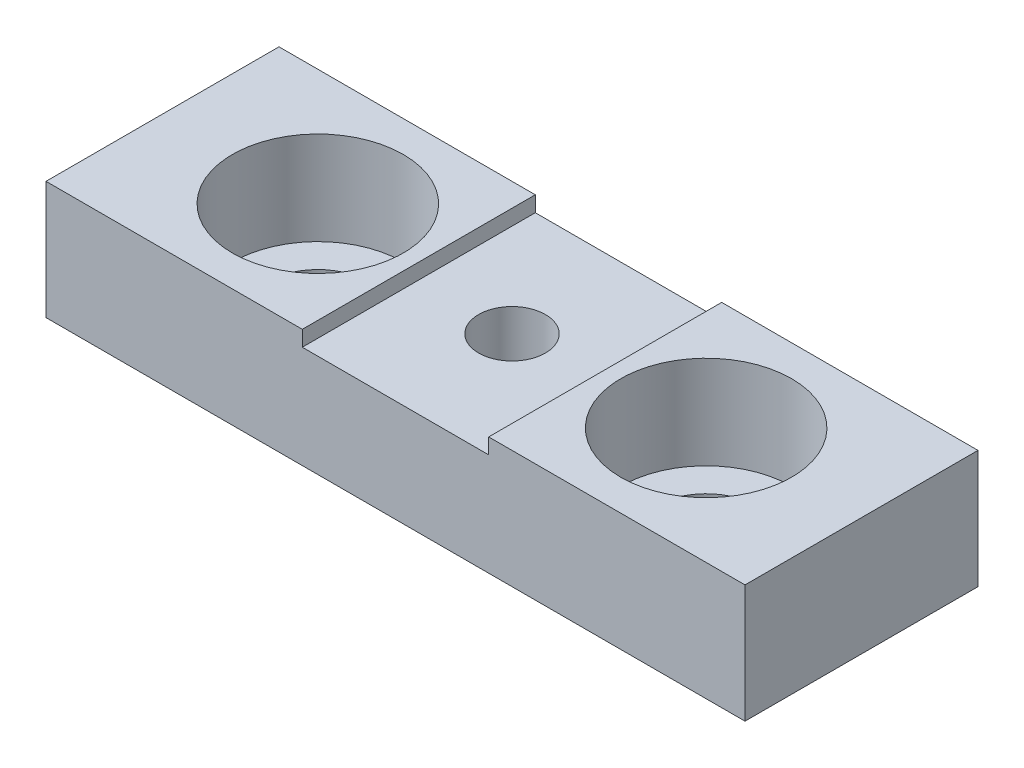
ISO-10303-21;
HEADER;
FILE_DESCRIPTION(('STEP AP214'),'2;1');
FILE_NAME('part.step','',(''),(''),'','','');
FILE_SCHEMA(('AUTOMOTIVE_DESIGN { 1 0 10303 214 1 1 1 1 }'));
ENDSEC;
DATA;
#1=APPLICATION_CONTEXT('core data for automotive mechanical design processes');
#2=APPLICATION_PROTOCOL_DEFINITION('international standard','automotive_design',2000,#1);
#3=PRODUCT_CONTEXT('',#1,'mechanical');
#4=PRODUCT('Part','Part','',(#3));
#5=PRODUCT_RELATED_PRODUCT_CATEGORY('part','',(#4));
#6=PRODUCT_DEFINITION_FORMATION('','',#4);
#7=PRODUCT_DEFINITION_CONTEXT('part definition',#1,'design');
#8=PRODUCT_DEFINITION('design','',#6,#7);
#9=PRODUCT_DEFINITION_SHAPE('','',#8);
#10=(LENGTH_UNIT() NAMED_UNIT(*) SI_UNIT(.MILLI.,.METRE.));
#11=(NAMED_UNIT(*) PLANE_ANGLE_UNIT() SI_UNIT($,.RADIAN.));
#12=(NAMED_UNIT(*) SI_UNIT($,.STERADIAN.) SOLID_ANGLE_UNIT());
#13=UNCERTAINTY_MEASURE_WITH_UNIT(LENGTH_MEASURE(1.E-05),#10,'distance_accuracy_value','');
#14=(GEOMETRIC_REPRESENTATION_CONTEXT(3) GLOBAL_UNCERTAINTY_ASSIGNED_CONTEXT((#13)) GLOBAL_UNIT_ASSIGNED_CONTEXT((#10,
#11,#12)) REPRESENTATION_CONTEXT('',''));
#15=CARTESIAN_POINT('',(0.,0.,0.));
#16=DIRECTION('',(0.,0.,1.));
#17=DIRECTION('',(1.,0.,0.));
#18=AXIS2_PLACEMENT_3D('',#15,#16,#17);
#19=CARTESIAN_POINT('',(0.,7.6,0.));
#20=DIRECTION('',(0.,-1.,0.));
#21=DIRECTION('',(0.,0.,-1.));
#22=AXIS2_PLACEMENT_3D('',#19,#20,#21);
#23=PLANE('',#22);
#24=CARTESIAN_POINT('',(-12.5,7.6,0.));
#25=DIRECTION('',(0.,1.,0.));
#26=DIRECTION('',(0.,0.,1.));
#27=AXIS2_PLACEMENT_3D('',#24,#25,#26);
#28=CIRCLE('',#27,5.5);
#29=CARTESIAN_POINT('',(-12.5,7.6,5.5));
#30=VERTEX_POINT('',#29);
#31=EDGE_CURVE('E134',#30,#30,#28,.T.);
#32=ORIENTED_EDGE('',*,*,#31,.F.);
#33=EDGE_LOOP('',(#32));
#34=FACE_BOUND('',#33,.T.);
#35=DIRECTION('',(1.,0.,0.));
#36=VECTOR('',#35,1.);
#37=CARTESIAN_POINT('',(-22.5,7.6,7.5));
#38=LINE('',#37,#36);
#39=CARTESIAN_POINT('',(-22.5,7.6,7.5));
#40=VERTEX_POINT('',#39);
#41=CARTESIAN_POINT('',(-6.,7.6,7.5));
#42=VERTEX_POINT('',#41);
#43=EDGE_CURVE('E168',#40,#42,#38,.T.);
#44=ORIENTED_EDGE('',*,*,#43,.T.);
#45=DIRECTION('',(0.,0.,1.));
#46=VECTOR('',#45,1.);
#47=CARTESIAN_POINT('',(-6.,7.6,-7.5));
#48=LINE('',#47,#46);
#49=CARTESIAN_POINT('',(-6.,7.6,-7.5));
#50=VERTEX_POINT('',#49);
#51=EDGE_CURVE('E199',#50,#42,#48,.T.);
#52=ORIENTED_EDGE('',*,*,#51,.F.);
#53=DIRECTION('',(-1.,0.,0.));
#54=VECTOR('',#53,1.);
#55=CARTESIAN_POINT('',(-22.5,7.6,-7.5));
#56=LINE('',#55,#54);
#57=CARTESIAN_POINT('',(-22.5,7.6,-7.5));
#58=VERTEX_POINT('',#57);
#59=EDGE_CURVE('E164',#50,#58,#56,.T.);
#60=ORIENTED_EDGE('',*,*,#59,.T.);
#61=DIRECTION('',(0.,0.,1.));
#62=VECTOR('',#61,1.);
#63=CARTESIAN_POINT('',(-22.5,7.6,7.5));
#64=LINE('',#63,#62);
#65=EDGE_CURVE('E166',#58,#40,#64,.T.);
#66=ORIENTED_EDGE('',*,*,#65,.T.);
#67=EDGE_LOOP('',(#44,#52,#60,#66));
#68=FACE_BOUND('',#67,.T.);
#69=ADVANCED_FACE('F36',(#34,#68),#23,.F.);
#70=CARTESIAN_POINT('',(0.,7.6,0.));
#71=DIRECTION('',(0.,-1.,0.));
#72=DIRECTION('',(0.,0.,-1.));
#73=AXIS2_PLACEMENT_3D('',#70,#71,#72);
#74=CYLINDRICAL_SURFACE('',#73,2.15);
#75=CARTESIAN_POINT('',(0.,0.,0.));
#76=DIRECTION('',(0.,1.,0.));
#77=DIRECTION('',(0.,0.,1.));
#78=AXIS2_PLACEMENT_3D('',#75,#76,#77);
#79=CIRCLE('',#78,2.15);
#80=CARTESIAN_POINT('',(0.,0.,2.15));
#81=VERTEX_POINT('',#80);
#82=EDGE_CURVE('E158',#81,#81,#79,.T.);
#83=ORIENTED_EDGE('',*,*,#82,.F.);
#84=EDGE_LOOP('',(#83));
#85=FACE_BOUND('',#84,.T.);
#86=CARTESIAN_POINT('',(0.,6.6,0.));
#87=DIRECTION('',(0.,1.,0.));
#88=DIRECTION('',(0.,0.,1.));
#89=AXIS2_PLACEMENT_3D('',#86,#87,#88);
#90=CIRCLE('',#89,2.15);
#91=CARTESIAN_POINT('',(0.,6.6,2.15));
#92=VERTEX_POINT('',#91);
#93=EDGE_CURVE('E40',#92,#92,#90,.T.);
#94=ORIENTED_EDGE('',*,*,#93,.T.);
#95=EDGE_LOOP('',(#94));
#96=FACE_BOUND('',#95,.T.);
#97=ADVANCED_FACE('F210',(#85,#96),#74,.F.);
#98=CARTESIAN_POINT('',(0.,0.,0.));
#99=DIRECTION('',(0.,-1.,0.));
#100=DIRECTION('',(0.,0.,-1.));
#101=AXIS2_PLACEMENT_3D('',#98,#99,#100);
#102=PLANE('',#101);
#103=ORIENTED_EDGE('',*,*,#82,.T.);
#104=EDGE_LOOP('',(#103));
#105=FACE_BOUND('',#104,.T.);
#106=DIRECTION('',(0.,0.,-1.));
#107=VECTOR('',#106,1.);
#108=CARTESIAN_POINT('',(22.5,0.,7.5));
#109=LINE('',#108,#107);
#110=CARTESIAN_POINT('',(22.5,0.,7.5));
#111=VERTEX_POINT('',#110);
#112=CARTESIAN_POINT('',(22.5,0.,-7.5));
#113=VERTEX_POINT('',#112);
#114=EDGE_CURVE('E161',#111,#113,#109,.T.);
#115=ORIENTED_EDGE('',*,*,#114,.F.);
#116=DIRECTION('',(1.,0.,0.));
#117=VECTOR('',#116,1.);
#118=CARTESIAN_POINT('',(-22.5,0.,7.5));
#119=LINE('',#118,#117);
#120=CARTESIAN_POINT('',(-22.5,0.,7.5));
#121=VERTEX_POINT('',#120);
#122=EDGE_CURVE('E83',#121,#111,#119,.T.);
#123=ORIENTED_EDGE('',*,*,#122,.F.);
#124=DIRECTION('',(0.,0.,1.));
#125=VECTOR('',#124,1.);
#126=CARTESIAN_POINT('',(-22.5,0.,7.5));
#127=LINE('',#126,#125);
#128=CARTESIAN_POINT('',(-22.5,0.,-7.5));
#129=VERTEX_POINT('',#128);
#130=EDGE_CURVE('E176',#129,#121,#127,.T.);
#131=ORIENTED_EDGE('',*,*,#130,.F.);
#132=DIRECTION('',(-1.,0.,0.));
#133=VECTOR('',#132,1.);
#134=CARTESIAN_POINT('',(-22.5,0.,-7.5));
#135=LINE('',#134,#133);
#136=EDGE_CURVE('E174',#113,#129,#135,.T.);
#137=ORIENTED_EDGE('',*,*,#136,.F.);
#138=EDGE_LOOP('',(#115,#123,#131,#137));
#139=FACE_BOUND('',#138,.T.);
#140=CARTESIAN_POINT('',(12.5,0.,0.));
#141=DIRECTION('',(0.,1.,0.));
#142=DIRECTION('',(0.,0.,1.));
#143=AXIS2_PLACEMENT_3D('',#140,#141,#142);
#144=CIRCLE('',#143,3.3);
#145=CARTESIAN_POINT('',(12.5,0.,3.3));
#146=VERTEX_POINT('',#145);
#147=EDGE_CURVE('E155',#146,#146,#144,.T.);
#148=ORIENTED_EDGE('',*,*,#147,.T.);
#149=EDGE_LOOP('',(#148));
#150=FACE_BOUND('',#149,.T.);
#151=CARTESIAN_POINT('',(-12.5,0.,0.));
#152=DIRECTION('',(0.,1.,0.));
#153=DIRECTION('',(0.,0.,1.));
#154=AXIS2_PLACEMENT_3D('',#151,#152,#153);
#155=CIRCLE('',#154,3.3);
#156=CARTESIAN_POINT('',(-12.5,0.,3.3));
#157=VERTEX_POINT('',#156);
#158=EDGE_CURVE('E143',#157,#157,#155,.T.);
#159=ORIENTED_EDGE('',*,*,#158,.T.);
#160=EDGE_LOOP('',(#159));
#161=FACE_BOUND('',#160,.T.);
#162=ADVANCED_FACE('F192',(#105,#139,#150,#161),#102,.T.);
#163=CARTESIAN_POINT('',(12.5,7.6,0.));
#164=DIRECTION('',(0.,1.,0.));
#165=DIRECTION('',(0.,0.,1.));
#166=AXIS2_PLACEMENT_3D('',#163,#164,#165);
#167=CIRCLE('',#166,5.5);
#168=CARTESIAN_POINT('',(12.5,7.6,5.5));
#169=VERTEX_POINT('',#168);
#170=EDGE_CURVE('E146',#169,#169,#167,.T.);
#171=ORIENTED_EDGE('',*,*,#170,.F.);
#172=EDGE_LOOP('',(#171));
#173=FACE_BOUND('',#172,.T.);
#174=CARTESIAN_POINT('',(22.5,7.6,-7.5));
#175=VERTEX_POINT('',#174);
#176=CARTESIAN_POINT('',(6.,7.6,-7.5));
#177=VERTEX_POINT('',#176);
#178=EDGE_CURVE('E90',#175,#177,#56,.T.);
#179=ORIENTED_EDGE('',*,*,#178,.T.);
#180=DIRECTION('',(0.,0.,-1.));
#181=VECTOR('',#180,1.);
#182=CARTESIAN_POINT('',(6.,7.6,-7.5));
#183=LINE('',#182,#181);
#184=CARTESIAN_POINT('',(6.,7.6,7.5));
#185=VERTEX_POINT('',#184);
#186=EDGE_CURVE('E198',#185,#177,#183,.T.);
#187=ORIENTED_EDGE('',*,*,#186,.F.);
#188=CARTESIAN_POINT('',(22.5,7.6,7.5));
#189=VERTEX_POINT('',#188);
#190=EDGE_CURVE('E61',#185,#189,#38,.T.);
#191=ORIENTED_EDGE('',*,*,#190,.T.);
#192=DIRECTION('',(0.,0.,-1.));
#193=VECTOR('',#192,1.);
#194=CARTESIAN_POINT('',(22.5,7.6,7.5));
#195=LINE('',#194,#193);
#196=EDGE_CURVE('E162',#189,#175,#195,.T.);
#197=ORIENTED_EDGE('',*,*,#196,.T.);
#198=EDGE_LOOP('',(#179,#187,#191,#197));
#199=FACE_BOUND('',#198,.T.);
#200=ADVANCED_FACE('F197',(#173,#199),#23,.F.);
#201=CARTESIAN_POINT('',(22.5,7.6,7.5));
#202=DIRECTION('',(-1.,0.,0.));
#203=DIRECTION('',(0.,0.,1.));
#204=AXIS2_PLACEMENT_3D('',#201,#202,#203);
#205=PLANE('',#204);
#206=ORIENTED_EDGE('',*,*,#114,.T.);
#207=DIRECTION('',(0.,-1.,0.));
#208=VECTOR('',#207,1.);
#209=CARTESIAN_POINT('',(22.5,7.6,-7.5));
#210=LINE('',#209,#208);
#211=EDGE_CURVE('E11',#175,#113,#210,.T.);
#212=ORIENTED_EDGE('',*,*,#211,.F.);
#213=ORIENTED_EDGE('',*,*,#196,.F.);
#214=DIRECTION('',(0.,-1.,0.));
#215=VECTOR('',#214,1.);
#216=CARTESIAN_POINT('',(22.5,7.6,7.5));
#217=LINE('',#216,#215);
#218=EDGE_CURVE('E171',#189,#111,#217,.T.);
#219=ORIENTED_EDGE('',*,*,#218,.T.);
#220=EDGE_LOOP('',(#206,#212,#213,#219));
#221=FACE_BOUND('',#220,.T.);
#222=ADVANCED_FACE('F38',(#221),#205,.F.);
#223=CARTESIAN_POINT('',(-22.5,7.6,-7.5));
#224=DIRECTION('',(0.,0.,1.));
#225=DIRECTION('',(1.,0.,0.));
#226=AXIS2_PLACEMENT_3D('',#223,#224,#225);
#227=PLANE('',#226);
#228=ORIENTED_EDGE('',*,*,#59,.F.);
#229=DIRECTION('',(0.,1.,0.));
#230=VECTOR('',#229,1.);
#231=CARTESIAN_POINT('',(-6.,6.6,-7.5));
#232=LINE('',#231,#230);
#233=CARTESIAN_POINT('',(-6.,6.6,-7.5));
#234=VERTEX_POINT('',#233);
#235=EDGE_CURVE('E129',#234,#50,#232,.T.);
#236=ORIENTED_EDGE('',*,*,#235,.F.);
#237=DIRECTION('',(-1.,0.,0.));
#238=VECTOR('',#237,1.);
#239=CARTESIAN_POINT('',(-6.,6.6,-7.5));
#240=LINE('',#239,#238);
#241=CARTESIAN_POINT('',(6.,6.6,-7.5));
#242=VERTEX_POINT('',#241);
#243=EDGE_CURVE('E119',#242,#234,#240,.T.);
#244=ORIENTED_EDGE('',*,*,#243,.F.);
#245=DIRECTION('',(0.,1.,0.));
#246=VECTOR('',#245,1.);
#247=CARTESIAN_POINT('',(6.,6.6,-7.5));
#248=LINE('',#247,#246);
#249=EDGE_CURVE('E117',#242,#177,#248,.T.);
#250=ORIENTED_EDGE('',*,*,#249,.T.);
#251=ORIENTED_EDGE('',*,*,#178,.F.);
#252=ORIENTED_EDGE('',*,*,#211,.T.);
#253=ORIENTED_EDGE('',*,*,#136,.T.);
#254=DIRECTION('',(0.,-1.,0.));
#255=VECTOR('',#254,1.);
#256=CARTESIAN_POINT('',(-22.5,7.6,-7.5));
#257=LINE('',#256,#255);
#258=EDGE_CURVE('E45',#58,#129,#257,.T.);
#259=ORIENTED_EDGE('',*,*,#258,.F.);
#260=EDGE_LOOP('',(#228,#236,#244,#250,#251,#252,#253,#259));
#261=FACE_BOUND('',#260,.T.);
#262=ADVANCED_FACE('F236',(#261),#227,.F.);
#263=CARTESIAN_POINT('',(-22.5,7.6,7.5));
#264=DIRECTION('',(1.,0.,0.));
#265=DIRECTION('',(0.,0.,-1.));
#266=AXIS2_PLACEMENT_3D('',#263,#264,#265);
#267=PLANE('',#266);
#268=ORIENTED_EDGE('',*,*,#130,.T.);
#269=DIRECTION('',(0.,-1.,0.));
#270=VECTOR('',#269,1.);
#271=CARTESIAN_POINT('',(-22.5,7.6,7.5));
#272=LINE('',#271,#270);
#273=EDGE_CURVE('E180',#40,#121,#272,.T.);
#274=ORIENTED_EDGE('',*,*,#273,.F.);
#275=ORIENTED_EDGE('',*,*,#65,.F.);
#276=ORIENTED_EDGE('',*,*,#258,.T.);
#277=EDGE_LOOP('',(#268,#274,#275,#276));
#278=FACE_BOUND('',#277,.T.);
#279=ADVANCED_FACE('F187',(#278),#267,.F.);
#280=CARTESIAN_POINT('',(-22.5,7.6,7.5));
#281=DIRECTION('',(0.,0.,-1.));
#282=DIRECTION('',(-1.,0.,0.));
#283=AXIS2_PLACEMENT_3D('',#280,#281,#282);
#284=PLANE('',#283);
#285=DIRECTION('',(1.,0.,0.));
#286=VECTOR('',#285,1.);
#287=CARTESIAN_POINT('',(-6.,6.6,7.5));
#288=LINE('',#287,#286);
#289=CARTESIAN_POINT('',(-6.,6.6,7.5));
#290=VERTEX_POINT('',#289);
#291=CARTESIAN_POINT('',(6.,6.6,7.5));
#292=VERTEX_POINT('',#291);
#293=EDGE_CURVE('E120',#290,#292,#288,.T.);
#294=ORIENTED_EDGE('',*,*,#293,.F.);
#295=DIRECTION('',(0.,1.,0.));
#296=VECTOR('',#295,1.);
#297=CARTESIAN_POINT('',(-6.,6.6,7.5));
#298=LINE('',#297,#296);
#299=EDGE_CURVE('E127',#290,#42,#298,.T.);
#300=ORIENTED_EDGE('',*,*,#299,.T.);
#301=ORIENTED_EDGE('',*,*,#43,.F.);
#302=ORIENTED_EDGE('',*,*,#273,.T.);
#303=ORIENTED_EDGE('',*,*,#122,.T.);
#304=ORIENTED_EDGE('',*,*,#218,.F.);
#305=ORIENTED_EDGE('',*,*,#190,.F.);
#306=DIRECTION('',(0.,1.,0.));
#307=VECTOR('',#306,1.);
#308=CARTESIAN_POINT('',(6.,6.6,7.5));
#309=LINE('',#308,#307);
#310=EDGE_CURVE('E116',#292,#185,#309,.T.);
#311=ORIENTED_EDGE('',*,*,#310,.F.);
#312=EDGE_LOOP('',(#294,#300,#301,#302,#303,#304,#305,#311));
#313=FACE_BOUND('',#312,.T.);
#314=ADVANCED_FACE('F126',(#313),#284,.F.);
#315=CARTESIAN_POINT('',(12.5,7.6,0.));
#316=DIRECTION('',(0.,1.,0.));
#317=DIRECTION('',(0.,0.,1.));
#318=AXIS2_PLACEMENT_3D('',#315,#316,#317);
#319=CYLINDRICAL_SURFACE('',#318,3.3);
#320=ORIENTED_EDGE('',*,*,#147,.F.);
#321=EDGE_LOOP('',(#320));
#322=FACE_BOUND('',#321,.T.);
#323=CARTESIAN_POINT('',(12.5,1.6,0.));
#324=DIRECTION('',(0.,1.,0.));
#325=DIRECTION('',(0.,0.,1.));
#326=AXIS2_PLACEMENT_3D('',#323,#324,#325);
#327=CIRCLE('',#326,3.3);
#328=CARTESIAN_POINT('',(12.5,1.6,3.3));
#329=VERTEX_POINT('',#328);
#330=EDGE_CURVE('E152',#329,#329,#327,.T.);
#331=ORIENTED_EDGE('',*,*,#330,.T.);
#332=EDGE_LOOP('',(#331));
#333=FACE_BOUND('',#332,.T.);
#334=ADVANCED_FACE('F253',(#322,#333),#319,.F.);
#335=CARTESIAN_POINT('',(15.8,1.6,0.));
#336=DIRECTION('',(0.,-1.,0.));
#337=DIRECTION('',(0.,0.,-1.));
#338=AXIS2_PLACEMENT_3D('',#335,#336,#337);
#339=PLANE('',#338);
#340=ORIENTED_EDGE('',*,*,#330,.F.);
#341=EDGE_LOOP('',(#340));
#342=FACE_BOUND('',#341,.T.);
#343=CARTESIAN_POINT('',(12.5,1.6,0.));
#344=DIRECTION('',(0.,1.,0.));
#345=DIRECTION('',(0.,0.,1.));
#346=AXIS2_PLACEMENT_3D('',#343,#344,#345);
#347=CIRCLE('',#346,5.5);
#348=CARTESIAN_POINT('',(12.5,1.6,5.5));
#349=VERTEX_POINT('',#348);
#350=EDGE_CURVE('E149',#349,#349,#347,.T.);
#351=ORIENTED_EDGE('',*,*,#350,.T.);
#352=EDGE_LOOP('',(#351));
#353=FACE_BOUND('',#352,.T.);
#354=ADVANCED_FACE('F243',(#342,#353),#339,.F.);
#355=CARTESIAN_POINT('',(12.5,7.6,0.));
#356=DIRECTION('',(0.,1.,0.));
#357=DIRECTION('',(0.,0.,1.));
#358=AXIS2_PLACEMENT_3D('',#355,#356,#357);
#359=CYLINDRICAL_SURFACE('',#358,5.5);
#360=ORIENTED_EDGE('',*,*,#350,.F.);
#361=EDGE_LOOP('',(#360));
#362=FACE_BOUND('',#361,.T.);
#363=ORIENTED_EDGE('',*,*,#170,.T.);
#364=EDGE_LOOP('',(#363));
#365=FACE_BOUND('',#364,.T.);
#366=ADVANCED_FACE('F240',(#362,#365),#359,.F.);
#367=CARTESIAN_POINT('',(-12.5,7.6,0.));
#368=DIRECTION('',(0.,1.,0.));
#369=DIRECTION('',(0.,0.,1.));
#370=AXIS2_PLACEMENT_3D('',#367,#368,#369);
#371=CYLINDRICAL_SURFACE('',#370,3.3);
#372=ORIENTED_EDGE('',*,*,#158,.F.);
#373=EDGE_LOOP('',(#372));
#374=FACE_BOUND('',#373,.T.);
#375=CARTESIAN_POINT('',(-12.5,1.6,0.));
#376=DIRECTION('',(0.,1.,0.));
#377=DIRECTION('',(0.,0.,1.));
#378=AXIS2_PLACEMENT_3D('',#375,#376,#377);
#379=CIRCLE('',#378,3.3);
#380=CARTESIAN_POINT('',(-12.5,1.6,3.3));
#381=VERTEX_POINT('',#380);
#382=EDGE_CURVE('E140',#381,#381,#379,.T.);
#383=ORIENTED_EDGE('',*,*,#382,.T.);
#384=EDGE_LOOP('',(#383));
#385=FACE_BOUND('',#384,.T.);
#386=ADVANCED_FACE('F242',(#374,#385),#371,.F.);
#387=CARTESIAN_POINT('',(-9.20000000000001,1.6,0.));
#388=DIRECTION('',(0.,-1.,0.));
#389=DIRECTION('',(0.,0.,-1.));
#390=AXIS2_PLACEMENT_3D('',#387,#388,#389);
#391=PLANE('',#390);
#392=ORIENTED_EDGE('',*,*,#382,.F.);
#393=EDGE_LOOP('',(#392));
#394=FACE_BOUND('',#393,.T.);
#395=CARTESIAN_POINT('',(-12.5,1.6,0.));
#396=DIRECTION('',(0.,1.,0.));
#397=DIRECTION('',(0.,0.,1.));
#398=AXIS2_PLACEMENT_3D('',#395,#396,#397);
#399=CIRCLE('',#398,5.5);
#400=CARTESIAN_POINT('',(-12.5,1.6,5.5));
#401=VERTEX_POINT('',#400);
#402=EDGE_CURVE('E137',#401,#401,#399,.T.);
#403=ORIENTED_EDGE('',*,*,#402,.T.);
#404=EDGE_LOOP('',(#403));
#405=FACE_BOUND('',#404,.T.);
#406=ADVANCED_FACE('F250',(#394,#405),#391,.F.);
#407=CARTESIAN_POINT('',(-12.5,7.6,0.));
#408=DIRECTION('',(0.,1.,0.));
#409=DIRECTION('',(0.,0.,1.));
#410=AXIS2_PLACEMENT_3D('',#407,#408,#409);
#411=CYLINDRICAL_SURFACE('',#410,5.5);
#412=ORIENTED_EDGE('',*,*,#402,.F.);
#413=EDGE_LOOP('',(#412));
#414=FACE_BOUND('',#413,.T.);
#415=ORIENTED_EDGE('',*,*,#31,.T.);
#416=EDGE_LOOP('',(#415));
#417=FACE_BOUND('',#416,.T.);
#418=ADVANCED_FACE('F276',(#414,#417),#411,.F.);
#419=CARTESIAN_POINT('',(-6.,6.6,-7.5));
#420=DIRECTION('',(-1.,0.,0.));
#421=DIRECTION('',(0.,0.,1.));
#422=AXIS2_PLACEMENT_3D('',#419,#420,#421);
#423=PLANE('',#422);
#424=ORIENTED_EDGE('',*,*,#51,.T.);
#425=ORIENTED_EDGE('',*,*,#299,.F.);
#426=DIRECTION('',(0.,0.,1.));
#427=VECTOR('',#426,1.);
#428=CARTESIAN_POINT('',(-6.,6.6,-7.5));
#429=LINE('',#428,#427);
#430=EDGE_CURVE('E52',#234,#290,#429,.T.);
#431=ORIENTED_EDGE('',*,*,#430,.F.);
#432=ORIENTED_EDGE('',*,*,#235,.T.);
#433=EDGE_LOOP('',(#424,#425,#431,#432));
#434=FACE_BOUND('',#433,.T.);
#435=ADVANCED_FACE('F217',(#434),#423,.F.);
#436=CARTESIAN_POINT('',(6.,6.6,-7.5));
#437=DIRECTION('',(1.,0.,0.));
#438=DIRECTION('',(0.,0.,-1.));
#439=AXIS2_PLACEMENT_3D('',#436,#437,#438);
#440=PLANE('',#439);
#441=ORIENTED_EDGE('',*,*,#186,.T.);
#442=ORIENTED_EDGE('',*,*,#249,.F.);
#443=DIRECTION('',(0.,0.,-1.));
#444=VECTOR('',#443,1.);
#445=CARTESIAN_POINT('',(6.,6.6,-7.5));
#446=LINE('',#445,#444);
#447=EDGE_CURVE('E113',#292,#242,#446,.T.);
#448=ORIENTED_EDGE('',*,*,#447,.F.);
#449=ORIENTED_EDGE('',*,*,#310,.T.);
#450=EDGE_LOOP('',(#441,#442,#448,#449));
#451=FACE_BOUND('',#450,.T.);
#452=ADVANCED_FACE('F114',(#451),#440,.F.);
#453=CARTESIAN_POINT('',(0.,6.6,0.));
#454=DIRECTION('',(0.,1.,0.));
#455=DIRECTION('',(0.,0.,1.));
#456=AXIS2_PLACEMENT_3D('',#453,#454,#455);
#457=PLANE('',#456);
#458=ORIENTED_EDGE('',*,*,#93,.F.);
#459=EDGE_LOOP('',(#458));
#460=FACE_BOUND('',#459,.T.);
#461=ORIENTED_EDGE('',*,*,#430,.T.);
#462=ORIENTED_EDGE('',*,*,#293,.T.);
#463=ORIENTED_EDGE('',*,*,#447,.T.);
#464=ORIENTED_EDGE('',*,*,#243,.T.);
#465=EDGE_LOOP('',(#461,#462,#463,#464));
#466=FACE_BOUND('',#465,.T.);
#467=ADVANCED_FACE('F123',(#460,#466),#457,.T.);
#468=CLOSED_SHELL('',(#69,#97,#162,#200,#222,#262,#279,#314,#334,#354,#366,#386,#406,#418,#435,
#452,#467));
#469=MANIFOLD_SOLID_BREP('B2',#468);
#470=ADVANCED_BREP_SHAPE_REPRESENTATION('',(#18,#469),#14);
#471=SHAPE_DEFINITION_REPRESENTATION(#9,#470);
ENDSEC;
END-ISO-10303-21;
